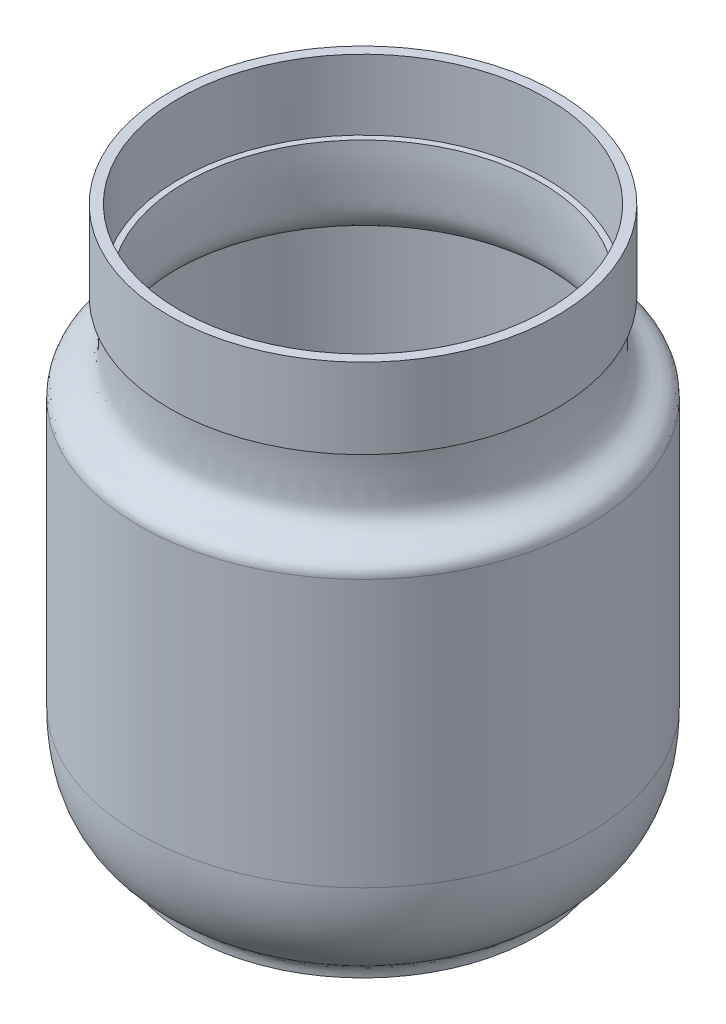
ISO-10303-21;
HEADER;
FILE_DESCRIPTION(('STEP AP214'),'2;1');
FILE_NAME('part.step','',(''),(''),'','','');
FILE_SCHEMA(('AUTOMOTIVE_DESIGN { 1 0 10303 214 1 1 1 1 }'));
ENDSEC;
DATA;
#1=APPLICATION_CONTEXT('core data for automotive mechanical design processes');
#2=APPLICATION_PROTOCOL_DEFINITION('international standard','automotive_design',2000,#1);
#3=PRODUCT_CONTEXT('',#1,'mechanical');
#4=PRODUCT('Part','Part','',(#3));
#5=PRODUCT_RELATED_PRODUCT_CATEGORY('part','',(#4));
#6=PRODUCT_DEFINITION_FORMATION('','',#4);
#7=PRODUCT_DEFINITION_CONTEXT('part definition',#1,'design');
#8=PRODUCT_DEFINITION('design','',#6,#7);
#9=PRODUCT_DEFINITION_SHAPE('','',#8);
#10=(LENGTH_UNIT() NAMED_UNIT(*) SI_UNIT(.MILLI.,.METRE.));
#11=(NAMED_UNIT(*) PLANE_ANGLE_UNIT() SI_UNIT($,.RADIAN.));
#12=(NAMED_UNIT(*) SI_UNIT($,.STERADIAN.) SOLID_ANGLE_UNIT());
#13=UNCERTAINTY_MEASURE_WITH_UNIT(LENGTH_MEASURE(1.E-05),#10,'distance_accuracy_value','');
#14=(GEOMETRIC_REPRESENTATION_CONTEXT(3) GLOBAL_UNCERTAINTY_ASSIGNED_CONTEXT((#13)) GLOBAL_UNIT_ASSIGNED_CONTEXT((#10,
#11,#12)) REPRESENTATION_CONTEXT('',''));
#15=CARTESIAN_POINT('',(0.,0.,0.));
#16=DIRECTION('',(0.,0.,1.));
#17=DIRECTION('',(1.,0.,0.));
#18=AXIS2_PLACEMENT_3D('',#15,#16,#17);
#19=CARTESIAN_POINT('',(0.,0.,0.));
#20=DIRECTION('',(0.,1.,0.));
#21=DIRECTION('',(0.,0.,1.));
#22=AXIS2_PLACEMENT_3D('',#19,#20,#21);
#23=PLANE('',#22);
#24=CARTESIAN_POINT('',(0.,0.,0.));
#25=DIRECTION('',(0.,1.,0.));
#26=DIRECTION('',(0.,0.,1.));
#27=AXIS2_PLACEMENT_3D('',#24,#25,#26);
#28=CIRCLE('',#27,26.);
#29=CARTESIAN_POINT('',(0.,0.,26.));
#30=VERTEX_POINT('',#29);
#31=EDGE_CURVE('E10',#30,#30,#28,.T.);
#32=ORIENTED_EDGE('',*,*,#31,.F.);
#33=EDGE_LOOP('',(#32));
#34=FACE_BOUND('',#33,.T.);
#35=ADVANCED_FACE('F33',(#34),#23,.F.);
#36=CARTESIAN_POINT('',(26.,0.,0.));
#37=CARTESIAN_POINT('',(26.0698831676113,1.70267988196263,0.));
#38=CARTESIAN_POINT('',(26.3798617941928,1.82203979984379,0.));
#39=CARTESIAN_POINT('',(27.9010955046396,2.95166797955115,0.));
#40=B_SPLINE_CURVE_WITH_KNOTS('',3,(#36,#37,#38,#39),.UNSPECIFIED.,.F.,.F.,(4,4),(0.,1.),.UNSPECIFIED.);
#41=CARTESIAN_POINT('',(0.,0.,0.));
#42=DIRECTION('',(0.,1.,0.));
#43=AXIS1_PLACEMENT('',#41,#42);
#44=SURFACE_OF_REVOLUTION('',#40,#43);
#45=CARTESIAN_POINT('',(0.,2.95166797955115,0.));
#46=DIRECTION('',(0.,1.,0.));
#47=DIRECTION('',(0.,0.,1.));
#48=AXIS2_PLACEMENT_3D('',#45,#46,#47);
#49=CIRCLE('',#48,27.9010955046396);
#50=CARTESIAN_POINT('',(0.,2.95166797955115,27.9010955046396));
#51=VERTEX_POINT('',#50);
#52=EDGE_CURVE('E39',#51,#51,#49,.T.);
#53=ORIENTED_EDGE('',*,*,#52,.F.);
#54=EDGE_LOOP('',(#53));
#55=FACE_BOUND('',#54,.T.);
#56=ORIENTED_EDGE('',*,*,#31,.T.);
#57=EDGE_LOOP('',(#56));
#58=FACE_BOUND('',#57,.T.);
#59=ADVANCED_FACE('F109',(#55,#58),#44,.T.);
#60=CARTESIAN_POINT('',(27.9010955046396,2.95166797955115,0.));
#61=CARTESIAN_POINT('',(31.9241444853809,6.16049387795153,0.));
#62=CARTESIAN_POINT('',(33.5,10.8368861623553,0.));
#63=CARTESIAN_POINT('',(33.5,17.,0.));
#64=B_SPLINE_CURVE_WITH_KNOTS('',3,(#60,#61,#62,#63),.UNSPECIFIED.,.F.,.F.,(4,4),(0.,1.),.UNSPECIFIED.);
#65=CARTESIAN_POINT('',(0.,0.,0.));
#66=DIRECTION('',(0.,1.,0.));
#67=AXIS1_PLACEMENT('',#65,#66);
#68=SURFACE_OF_REVOLUTION('',#64,#67);
#69=CARTESIAN_POINT('',(0.,17.,0.));
#70=DIRECTION('',(0.,1.,0.));
#71=DIRECTION('',(0.,0.,1.));
#72=AXIS2_PLACEMENT_3D('',#69,#70,#71);
#73=CIRCLE('',#72,33.5);
#74=CARTESIAN_POINT('',(0.,17.,33.5));
#75=VERTEX_POINT('',#74);
#76=EDGE_CURVE('E43',#75,#75,#73,.T.);
#77=ORIENTED_EDGE('',*,*,#76,.F.);
#78=EDGE_LOOP('',(#77));
#79=FACE_BOUND('',#78,.T.);
#80=ORIENTED_EDGE('',*,*,#52,.T.);
#81=EDGE_LOOP('',(#80));
#82=FACE_BOUND('',#81,.T.);
#83=ADVANCED_FACE('F104',(#79,#82),#68,.T.);
#84=CARTESIAN_POINT('',(0.,0.,0.));
#85=DIRECTION('',(0.,1.,0.));
#86=DIRECTION('',(0.,0.,1.));
#87=AXIS2_PLACEMENT_3D('',#84,#85,#86);
#88=CYLINDRICAL_SURFACE('',#87,33.5);
#89=CARTESIAN_POINT('',(0.,57.,0.));
#90=DIRECTION('',(0.,1.,0.));
#91=DIRECTION('',(0.,0.,1.));
#92=AXIS2_PLACEMENT_3D('',#89,#90,#91);
#93=CIRCLE('',#92,33.5);
#94=CARTESIAN_POINT('',(0.,57.,33.5));
#95=VERTEX_POINT('',#94);
#96=EDGE_CURVE('E47',#95,#95,#93,.T.);
#97=ORIENTED_EDGE('',*,*,#96,.F.);
#98=EDGE_LOOP('',(#97));
#99=FACE_BOUND('',#98,.T.);
#100=ORIENTED_EDGE('',*,*,#76,.T.);
#101=EDGE_LOOP('',(#100));
#102=FACE_BOUND('',#101,.T.);
#103=ADVANCED_FACE('F80',(#99,#102),#88,.T.);
#104=CARTESIAN_POINT('',(33.5,57.,0.));
#105=CARTESIAN_POINT('',(33.5,59.8769906844324,0.));
#106=CARTESIAN_POINT('',(28.1122131354538,58.5460677317613,0.));
#107=CARTESIAN_POINT('',(27.9747754257392,64.9047658064629,0.));
#108=CARTESIAN_POINT('',(27.859034819057,68.2379352382128,0.));
#109=CARTESIAN_POINT('',(28.,70.,0.));
#110=CARTESIAN_POINT('',(28.0368101911087,70.4601273888586,0.));
#111=CARTESIAN_POINT('',(28.0736203822174,70.9202547777171,0.));
#112=CARTESIAN_POINT('',(28.110430573326,71.3803821665757,0.));
#113=B_SPLINE_CURVE_WITH_KNOTS('',3,(#104,#105,#106,#107,#108,#109,#110,#111,#112),
.UNSPECIFIED.,.F.,.F.,(4,1,1,3,4),(0.,0.678310810246491,0.778310810246491,1.,1.05788962484897),.UNSPECIFIED.);
#114=CARTESIAN_POINT('',(0.,0.,0.));
#115=DIRECTION('',(0.,1.,0.));
#116=AXIS1_PLACEMENT('',#114,#115);
#117=SURFACE_OF_REVOLUTION('',#113,#116);
#118=CARTESIAN_POINT('',(0.,70.,0.));
#119=DIRECTION('',(0.,1.,0.));
#120=DIRECTION('',(0.,0.,1.));
#121=AXIS2_PLACEMENT_3D('',#118,#119,#120);
#122=CIRCLE('',#121,28.);
#123=CARTESIAN_POINT('',(0.,70.,28.));
#124=VERTEX_POINT('',#123);
#125=EDGE_CURVE('E52',#124,#124,#122,.T.);
#126=ORIENTED_EDGE('',*,*,#125,.F.);
#127=EDGE_LOOP('',(#126));
#128=FACE_BOUND('',#127,.T.);
#129=ORIENTED_EDGE('',*,*,#96,.T.);
#130=EDGE_LOOP('',(#129));
#131=FACE_BOUND('',#130,.T.);
#132=ADVANCED_FACE('F74',(#128,#131),#117,.T.);
#133=CARTESIAN_POINT('',(28.,70.,0.));
#134=DIRECTION('',(0.,1.,0.));
#135=DIRECTION('',(0.,0.,1.));
#136=AXIS2_PLACEMENT_3D('',#133,#134,#135);
#137=PLANE('',#136);
#138=CARTESIAN_POINT('',(0.,70.,0.));
#139=DIRECTION('',(0.,1.,0.));
#140=DIRECTION('',(0.,0.,1.));
#141=AXIS2_PLACEMENT_3D('',#138,#139,#140);
#142=CIRCLE('',#141,29.);
#143=CARTESIAN_POINT('',(0.,70.,29.));
#144=VERTEX_POINT('',#143);
#145=EDGE_CURVE('E55',#144,#144,#142,.T.);
#146=ORIENTED_EDGE('',*,*,#145,.F.);
#147=EDGE_LOOP('',(#146));
#148=FACE_BOUND('',#147,.T.);
#149=ORIENTED_EDGE('',*,*,#125,.T.);
#150=EDGE_LOOP('',(#149));
#151=FACE_BOUND('',#150,.T.);
#152=ADVANCED_FACE('F79',(#148,#151),#137,.F.);
#153=CARTESIAN_POINT('',(0.,0.,0.));
#154=DIRECTION('',(0.,1.,0.));
#155=DIRECTION('',(0.,0.,1.));
#156=AXIS2_PLACEMENT_3D('',#153,#154,#155);
#157=CYLINDRICAL_SURFACE('',#156,29.);
#158=CARTESIAN_POINT('',(0.,82.,0.));
#159=DIRECTION('',(0.,1.,0.));
#160=DIRECTION('',(0.,0.,1.));
#161=AXIS2_PLACEMENT_3D('',#158,#159,#160);
#162=CIRCLE('',#161,29.);
#163=CARTESIAN_POINT('',(0.,82.,29.));
#164=VERTEX_POINT('',#163);
#165=EDGE_CURVE('E58',#164,#164,#162,.T.);
#166=ORIENTED_EDGE('',*,*,#165,.F.);
#167=EDGE_LOOP('',(#166));
#168=FACE_BOUND('',#167,.T.);
#169=ORIENTED_EDGE('',*,*,#145,.T.);
#170=EDGE_LOOP('',(#169));
#171=FACE_BOUND('',#170,.T.);
#172=ADVANCED_FACE('F96',(#168,#171),#157,.T.);
#173=CARTESIAN_POINT('',(0.,82.,0.));
#174=DIRECTION('',(0.,-1.,0.));
#175=DIRECTION('',(0.,0.,-1.));
#176=AXIS2_PLACEMENT_3D('',#173,#174,#175);
#177=PLANE('',#176);
#178=CARTESIAN_POINT('',(0.,82.,0.));
#179=DIRECTION('',(0.,-1.,0.));
#180=DIRECTION('',(0.,0.,-1.));
#181=AXIS2_PLACEMENT_3D('',#178,#179,#180);
#182=CIRCLE('',#181,27.5);
#183=CARTESIAN_POINT('',(0.,82.,-27.5));
#184=VERTEX_POINT('',#183);
#185=EDGE_CURVE('E133',#184,#184,#182,.F.);
#186=ORIENTED_EDGE('',*,*,#185,.F.);
#187=EDGE_LOOP('',(#186));
#188=FACE_BOUND('',#187,.T.);
#189=ORIENTED_EDGE('',*,*,#165,.T.);
#190=EDGE_LOOP('',(#189));
#191=FACE_BOUND('',#190,.T.);
#192=ADVANCED_FACE('F92',(#188,#191),#177,.F.);
#193=CARTESIAN_POINT('',(0.,1.5,0.));
#194=DIRECTION('',(0.,1.,0.));
#195=DIRECTION('',(0.,0.,1.));
#196=AXIS2_PLACEMENT_3D('',#193,#194,#195);
#197=PLANE('',#196);
#198=CARTESIAN_POINT('',(0.,1.49999999999999,0.));
#199=DIRECTION('',(0.,1.,0.));
#200=DIRECTION('',(0.,0.,1.));
#201=AXIS2_PLACEMENT_3D('',#198,#199,#200);
#202=CIRCLE('',#201,24.6867608324286);
#203=CARTESIAN_POINT('',(0.,1.49999999999999,24.6867608324286));
#204=VERTEX_POINT('',#203);
#205=EDGE_CURVE('E61',#204,#204,#202,.T.);
#206=ORIENTED_EDGE('',*,*,#205,.T.);
#207=EDGE_LOOP('',(#206));
#208=FACE_BOUND('',#207,.T.);
#209=ADVANCED_FACE('F95',(#208),#197,.T.);
#210=CARTESIAN_POINT('',(26.,0.,0.));
#211=CARTESIAN_POINT('',(26.0698831676113,1.70267988196263,0.));
#212=CARTESIAN_POINT('',(26.3798617941928,1.82203979984379,0.));
#213=CARTESIAN_POINT('',(27.9010955046396,2.95166797955115,0.));
#214=B_SPLINE_CURVE_WITH_KNOTS('',3,(#210,#211,#212,#213),.UNSPECIFIED.,.F.,.F.,(4,4),(0.,1.),.UNSPECIFIED.);
#215=CARTESIAN_POINT('',(0.,0.,0.));
#216=DIRECTION('',(0.,1.,0.));
#217=AXIS1_PLACEMENT('',#215,#216);
#218=SURFACE_OF_REVOLUTION('',#214,#217);
#219=OFFSET_SURFACE('',#218,-1.5,.F.);
#220=CARTESIAN_POINT('',(0.,4.14018504407864,0.));
#221=DIRECTION('',(0.,1.,0.));
#222=DIRECTION('',(0.,0.,1.));
#223=AXIS2_PLACEMENT_3D('',#220,#221,#222);
#224=CIRCLE('',#223,26.9855934441889);
#225=CARTESIAN_POINT('',(0.,4.14018504407864,26.9855934441889));
#226=VERTEX_POINT('',#225);
#227=EDGE_CURVE('E151',#226,#226,#224,.T.);
#228=ORIENTED_EDGE('',*,*,#227,.T.);
#229=EDGE_LOOP('',(#228));
#230=FACE_BOUND('',#229,.T.);
#231=ORIENTED_EDGE('',*,*,#205,.F.);
#232=EDGE_LOOP('',(#231));
#233=FACE_BOUND('',#232,.T.);
#234=ADVANCED_FACE('F126',(#230,#233),#219,.F.);
#235=CARTESIAN_POINT('',(27.9010955046396,2.95166797955115,0.));
#236=CARTESIAN_POINT('',(31.9241444853809,6.16049387795153,0.));
#237=CARTESIAN_POINT('',(33.5,10.8368861623553,0.));
#238=CARTESIAN_POINT('',(33.5,17.,0.));
#239=B_SPLINE_CURVE_WITH_KNOTS('',3,(#235,#236,#237,#238),.UNSPECIFIED.,.F.,.F.,(4,4),(0.,1.),.UNSPECIFIED.);
#240=CARTESIAN_POINT('',(0.,0.,0.));
#241=DIRECTION('',(0.,1.,0.));
#242=AXIS1_PLACEMENT('',#240,#241);
#243=SURFACE_OF_REVOLUTION('',#239,#242);
#244=OFFSET_SURFACE('',#243,-1.5,.F.);
#245=CARTESIAN_POINT('',(0.,17.,0.));
#246=DIRECTION('',(0.,1.,0.));
#247=DIRECTION('',(0.,0.,1.));
#248=AXIS2_PLACEMENT_3D('',#245,#246,#247);
#249=CIRCLE('',#248,32.);
#250=CARTESIAN_POINT('',(0.,17.,32.));
#251=VERTEX_POINT('',#250);
#252=EDGE_CURVE('E148',#251,#251,#249,.T.);
#253=ORIENTED_EDGE('',*,*,#252,.T.);
#254=EDGE_LOOP('',(#253));
#255=FACE_BOUND('',#254,.T.);
#256=ORIENTED_EDGE('',*,*,#227,.F.);
#257=EDGE_LOOP('',(#256));
#258=FACE_BOUND('',#257,.T.);
#259=ADVANCED_FACE('F128',(#255,#258),#244,.F.);
#260=CARTESIAN_POINT('',(0.,0.,0.));
#261=DIRECTION('',(0.,1.,0.));
#262=DIRECTION('',(0.,0.,1.));
#263=AXIS2_PLACEMENT_3D('',#260,#261,#262);
#264=CYLINDRICAL_SURFACE('',#263,32.);
#265=CARTESIAN_POINT('',(0.,57.,0.));
#266=DIRECTION('',(0.,1.,0.));
#267=DIRECTION('',(1.,0.,0.));
#268=AXIS2_PLACEMENT_3D('',#265,#266,#267);
#269=CIRCLE('',#268,32.);
#270=CARTESIAN_POINT('',(32.,57.,0.));
#271=VERTEX_POINT('',#270);
#272=EDGE_CURVE('E145',#271,#271,#269,.T.);
#273=ORIENTED_EDGE('',*,*,#272,.T.);
#274=EDGE_LOOP('',(#273));
#275=FACE_BOUND('',#274,.T.);
#276=ORIENTED_EDGE('',*,*,#252,.F.);
#277=EDGE_LOOP('',(#276));
#278=FACE_BOUND('',#277,.T.);
#279=ADVANCED_FACE('F164',(#275,#278),#264,.F.);
#280=CARTESIAN_POINT('',(33.5,57.,0.));
#281=CARTESIAN_POINT('',(33.5,59.8769906844324,0.));
#282=CARTESIAN_POINT('',(28.1122131354538,58.5460677317613,0.));
#283=CARTESIAN_POINT('',(27.9747754257392,64.9047658064629,0.));
#284=CARTESIAN_POINT('',(27.859034819057,68.2379352382128,0.));
#285=CARTESIAN_POINT('',(28.0368101911087,70.4601273888586,0.));
#286=CARTESIAN_POINT('',(28.0736203822174,70.9202547777171,0.));
#287=CARTESIAN_POINT('',(28.110430573326,71.3803821665757,0.));
#288=B_SPLINE_CURVE_WITH_KNOTS('',3,(#280,#281,#282,#283,#284,#285,#286,#287),.UNSPECIFIED.,.F.,
.F.,(4,1,1,2,4),(0.,0.678310810246491,0.778310810246491,1.,1.05788962484897),.UNSPECIFIED.);
#289=CARTESIAN_POINT('',(0.,0.,0.));
#290=DIRECTION('',(0.,1.,0.));
#291=AXIS1_PLACEMENT('',#289,#290);
#292=SURFACE_OF_REVOLUTION('',#288,#291);
#293=OFFSET_SURFACE('',#292,-1.5,.F.);
#294=CARTESIAN_POINT('',(0.,71.5,0.));
#295=DIRECTION('',(0.,1.,0.));
#296=DIRECTION('',(0.,0.,1.));
#297=AXIS2_PLACEMENT_3D('',#294,#295,#296);
#298=CIRCLE('',#297,26.6152076555219);
#299=CARTESIAN_POINT('',(0.,71.5,26.6152076555219));
#300=VERTEX_POINT('',#299);
#301=EDGE_CURVE('E142',#300,#300,#298,.T.);
#302=ORIENTED_EDGE('',*,*,#301,.T.);
#303=EDGE_LOOP('',(#302));
#304=FACE_BOUND('',#303,.T.);
#305=ORIENTED_EDGE('',*,*,#272,.F.);
#306=EDGE_LOOP('',(#305));
#307=FACE_BOUND('',#306,.T.);
#308=ADVANCED_FACE('F82',(#304,#307),#293,.F.);
#309=CARTESIAN_POINT('',(28.,71.5,0.));
#310=DIRECTION('',(0.,1.,0.));
#311=DIRECTION('',(0.,0.,1.));
#312=AXIS2_PLACEMENT_3D('',#309,#310,#311);
#313=PLANE('',#312);
#314=CARTESIAN_POINT('',(0.,71.5,0.));
#315=DIRECTION('',(0.,1.,0.));
#316=DIRECTION('',(0.,0.,1.));
#317=AXIS2_PLACEMENT_3D('',#314,#315,#316);
#318=CIRCLE('',#317,27.5);
#319=CARTESIAN_POINT('',(0.,71.5,27.5));
#320=VERTEX_POINT('',#319);
#321=EDGE_CURVE('E139',#320,#320,#318,.T.);
#322=ORIENTED_EDGE('',*,*,#321,.T.);
#323=EDGE_LOOP('',(#322));
#324=FACE_BOUND('',#323,.T.);
#325=ORIENTED_EDGE('',*,*,#301,.F.);
#326=EDGE_LOOP('',(#325));
#327=FACE_BOUND('',#326,.T.);
#328=ADVANCED_FACE('F84',(#324,#327),#313,.T.);
#329=CARTESIAN_POINT('',(0.,0.,0.));
#330=DIRECTION('',(0.,1.,0.));
#331=DIRECTION('',(0.,0.,1.));
#332=AXIS2_PLACEMENT_3D('',#329,#330,#331);
#333=CYLINDRICAL_SURFACE('',#332,27.5);
#334=ORIENTED_EDGE('',*,*,#185,.T.);
#335=EDGE_LOOP('',(#334));
#336=FACE_BOUND('',#335,.T.);
#337=ORIENTED_EDGE('',*,*,#321,.F.);
#338=EDGE_LOOP('',(#337));
#339=FACE_BOUND('',#338,.T.);
#340=ADVANCED_FACE('F87',(#336,#339),#333,.F.);
#341=CLOSED_SHELL('',(#35,#59,#83,#103,#132,#152,#172,#192,#209,#234,#259,#279,#308,#328,#340));
#342=MANIFOLD_SOLID_BREP('B2',#341);
#343=ADVANCED_BREP_SHAPE_REPRESENTATION('',(#18,#342),#14);
#344=SHAPE_DEFINITION_REPRESENTATION(#9,#343);
ENDSEC;
END-ISO-10303-21;
